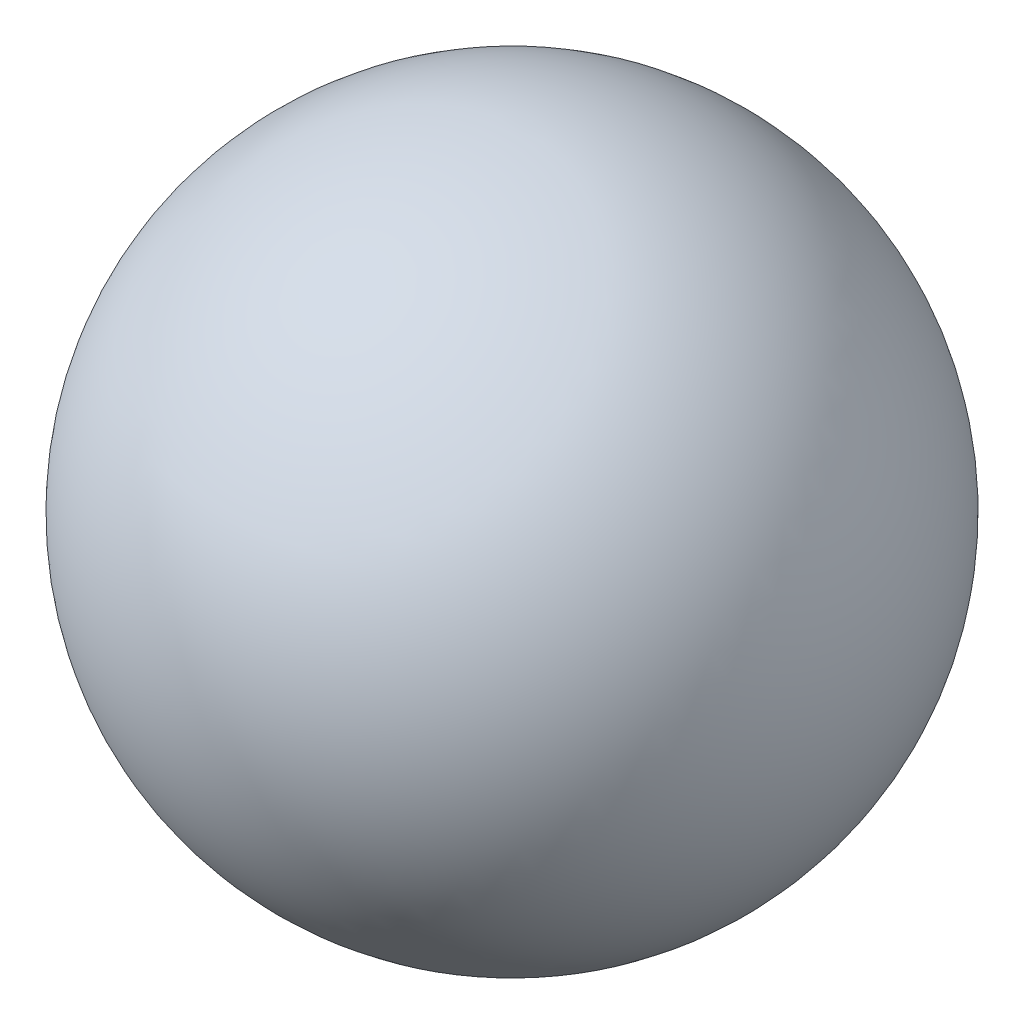
ISO-10303-21;
HEADER;
FILE_DESCRIPTION(('STEP AP214'),'2;1');
FILE_NAME('part.step','',(''),(''),'','','');
FILE_SCHEMA(('AUTOMOTIVE_DESIGN { 1 0 10303 214 1 1 1 1 }'));
ENDSEC;
DATA;
#1=APPLICATION_CONTEXT('core data for automotive mechanical design processes');
#2=APPLICATION_PROTOCOL_DEFINITION('international standard','automotive_design',2000,#1);
#3=PRODUCT_CONTEXT('',#1,'mechanical');
#4=PRODUCT('Part','Part','',(#3));
#5=PRODUCT_RELATED_PRODUCT_CATEGORY('part','',(#4));
#6=PRODUCT_DEFINITION_FORMATION('','',#4);
#7=PRODUCT_DEFINITION_CONTEXT('part definition',#1,'design');
#8=PRODUCT_DEFINITION('design','',#6,#7);
#9=PRODUCT_DEFINITION_SHAPE('','',#8);
#10=(LENGTH_UNIT() NAMED_UNIT(*) SI_UNIT(.MILLI.,.METRE.));
#11=(NAMED_UNIT(*) PLANE_ANGLE_UNIT() SI_UNIT($,.RADIAN.));
#12=(NAMED_UNIT(*) SI_UNIT($,.STERADIAN.) SOLID_ANGLE_UNIT());
#13=UNCERTAINTY_MEASURE_WITH_UNIT(LENGTH_MEASURE(1.E-05),#10,'distance_accuracy_value','');
#14=(GEOMETRIC_REPRESENTATION_CONTEXT(3) GLOBAL_UNCERTAINTY_ASSIGNED_CONTEXT((#13)) GLOBAL_UNIT_ASSIGNED_CONTEXT((#10,
#11,#12)) REPRESENTATION_CONTEXT('',''));
#15=CARTESIAN_POINT('',(0.,0.,0.));
#16=DIRECTION('',(0.,0.,1.));
#17=DIRECTION('',(1.,0.,0.));
#18=AXIS2_PLACEMENT_3D('',#15,#16,#17);
#19=CARTESIAN_POINT('',(0.,0.,0.));
#20=DIRECTION('',(0.,1.,0.));
#21=DIRECTION('',(0.,0.,-1.));
#22=AXIS2_PLACEMENT_3D('',#19,#20,#21);
#23=SPHERICAL_SURFACE('',#22,20.);
#24=CARTESIAN_POINT('',(0.,-19.6022708745058,0.));
#25=DIRECTION('',(0.,1.,0.));
#26=DIRECTION('',(0.,0.,1.));
#27=AXIS2_PLACEMENT_3D('',#24,#25,#26);
#28=CIRCLE('',#27,3.96875);
#29=CARTESIAN_POINT('',(0.,-19.6022708745058,3.96875));
#30=VERTEX_POINT('',#29);
#31=EDGE_CURVE('E10',#30,#30,#28,.F.);
#32=ORIENTED_EDGE('',*,*,#31,.F.);
#33=EDGE_LOOP('',(#32));
#34=FACE_BOUND('',#33,.T.);
#35=ADVANCED_FACE('F34',(#34),#23,.T.);
#36=CARTESIAN_POINT('',(0.,3.,0.));
#37=DIRECTION('',(0.,-1.,0.));
#38=DIRECTION('',(0.,0.,-1.));
#39=AXIS2_PLACEMENT_3D('',#36,#37,#38);
#40=CYLINDRICAL_SURFACE('',#39,3.96875);
#41=CARTESIAN_POINT('',(0.,3.,0.));
#42=DIRECTION('',(0.,1.,0.));
#43=DIRECTION('',(0.,0.,1.));
#44=AXIS2_PLACEMENT_3D('',#41,#42,#43);
#45=CIRCLE('',#44,3.96875);
#46=CARTESIAN_POINT('',(0.,3.,3.96875));
#47=VERTEX_POINT('',#46);
#48=EDGE_CURVE('E40',#47,#47,#45,.T.);
#49=ORIENTED_EDGE('',*,*,#48,.T.);
#50=EDGE_LOOP('',(#49));
#51=FACE_BOUND('',#50,.T.);
#52=ORIENTED_EDGE('',*,*,#31,.T.);
#53=EDGE_LOOP('',(#52));
#54=FACE_BOUND('',#53,.T.);
#55=ADVANCED_FACE('F46',(#51,#54),#40,.F.);
#56=CARTESIAN_POINT('',(0.,3.,0.));
#57=DIRECTION('',(0.,1.,0.));
#58=DIRECTION('',(0.,0.,1.));
#59=AXIS2_PLACEMENT_3D('',#56,#57,#58);
#60=PLANE('',#59);
#61=ORIENTED_EDGE('',*,*,#48,.F.);
#62=EDGE_LOOP('',(#61));
#63=FACE_BOUND('',#62,.T.);
#64=ADVANCED_FACE('F48',(#63),#60,.F.);
#65=CLOSED_SHELL('',(#35,#55,#64));
#66=MANIFOLD_SOLID_BREP('B2',#65);
#67=ADVANCED_BREP_SHAPE_REPRESENTATION('',(#18,#66),#14);
#68=SHAPE_DEFINITION_REPRESENTATION(#9,#67);
ENDSEC;
END-ISO-10303-21;
